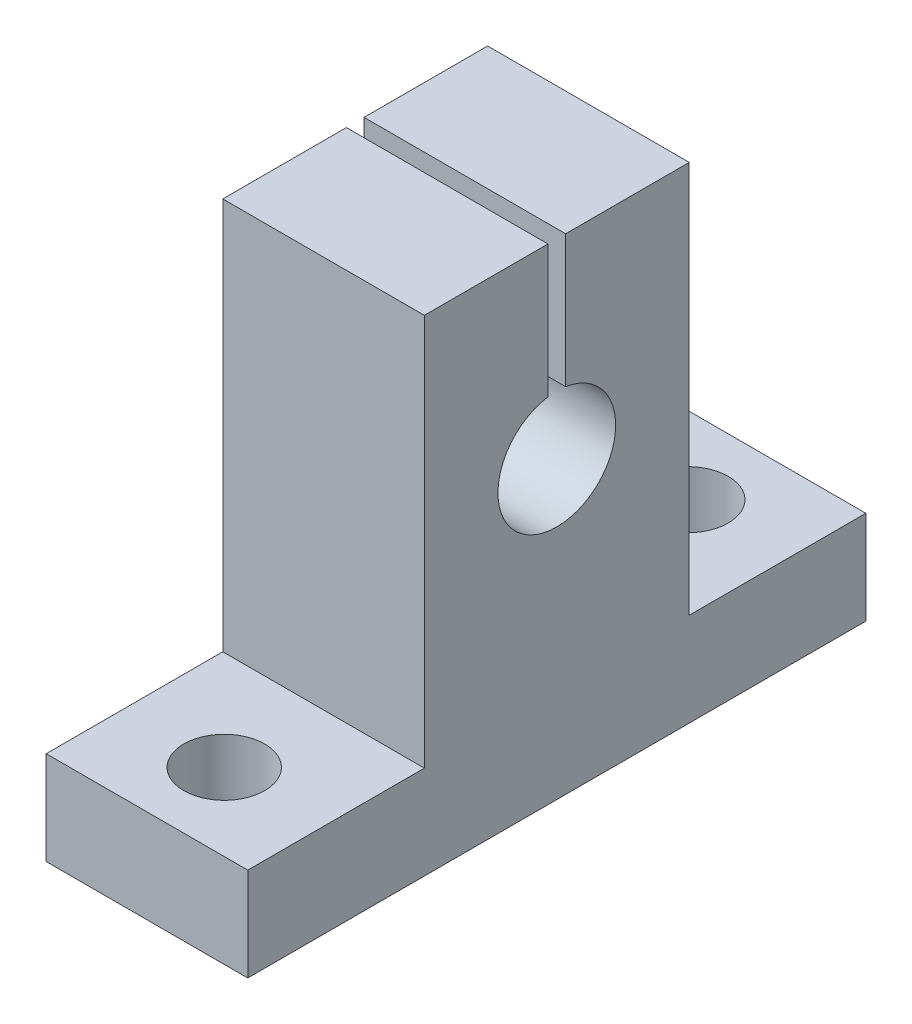
ISO-10303-21;
HEADER;
FILE_DESCRIPTION(('STEP AP214'),'2;1');
FILE_NAME('part.step','',(''),(''),'','','');
FILE_SCHEMA(('AUTOMOTIVE_DESIGN { 1 0 10303 214 1 1 1 1 }'));
ENDSEC;
DATA;
#1=APPLICATION_CONTEXT('core data for automotive mechanical design processes');
#2=APPLICATION_PROTOCOL_DEFINITION('international standard','automotive_design',2000,#1);
#3=PRODUCT_CONTEXT('',#1,'mechanical');
#4=PRODUCT('Part','Part','',(#3));
#5=PRODUCT_RELATED_PRODUCT_CATEGORY('part','',(#4));
#6=PRODUCT_DEFINITION_FORMATION('','',#4);
#7=PRODUCT_DEFINITION_CONTEXT('part definition',#1,'design');
#8=PRODUCT_DEFINITION('design','',#6,#7);
#9=PRODUCT_DEFINITION_SHAPE('','',#8);
#10=(LENGTH_UNIT() NAMED_UNIT(*) SI_UNIT(.MILLI.,.METRE.));
#11=(NAMED_UNIT(*) PLANE_ANGLE_UNIT() SI_UNIT($,.RADIAN.));
#12=(NAMED_UNIT(*) SI_UNIT($,.STERADIAN.) SOLID_ANGLE_UNIT());
#13=UNCERTAINTY_MEASURE_WITH_UNIT(LENGTH_MEASURE(1.E-05),#10,'distance_accuracy_value','');
#14=(GEOMETRIC_REPRESENTATION_CONTEXT(3) GLOBAL_UNCERTAINTY_ASSIGNED_CONTEXT((#13)) GLOBAL_UNIT_ASSIGNED_CONTEXT((#10,
#11,#12)) REPRESENTATION_CONTEXT('',''));
#15=CARTESIAN_POINT('',(0.,0.,0.));
#16=DIRECTION('',(0.,0.,1.));
#17=DIRECTION('',(1.,0.,0.));
#18=AXIS2_PLACEMENT_3D('',#15,#16,#17);
#19=CARTESIAN_POINT('',(0.,33.,0.));
#20=DIRECTION('',(0.,-1.,0.));
#21=DIRECTION('',(0.,0.,-1.));
#22=AXIS2_PLACEMENT_3D('',#19,#20,#21);
#23=PLANE('',#22);
#24=DIRECTION('',(0.,0.,-1.));
#25=VECTOR('',#24,1.);
#26=CARTESIAN_POINT('',(6.85,33.,9.));
#27=LINE('',#26,#25);
#28=CARTESIAN_POINT('',(6.85,33.,9.));
#29=VERTEX_POINT('',#28);
#30=CARTESIAN_POINT('',(6.85,33.,0.6));
#31=VERTEX_POINT('',#30);
#32=EDGE_CURVE('E154',#29,#31,#27,.T.);
#33=ORIENTED_EDGE('',*,*,#32,.T.);
#34=DIRECTION('',(-1.,0.,0.));
#35=VECTOR('',#34,1.);
#36=CARTESIAN_POINT('',(0.,33.,0.6));
#37=LINE('',#36,#35);
#38=CARTESIAN_POINT('',(-6.85,33.,0.6));
#39=VERTEX_POINT('',#38);
#40=EDGE_CURVE('E55',#31,#39,#37,.T.);
#41=ORIENTED_EDGE('',*,*,#40,.T.);
#42=DIRECTION('',(0.,0.,1.));
#43=VECTOR('',#42,1.);
#44=CARTESIAN_POINT('',(-6.85,33.,9.));
#45=LINE('',#44,#43);
#46=CARTESIAN_POINT('',(-6.85,33.,9.));
#47=VERTEX_POINT('',#46);
#48=EDGE_CURVE('E151',#39,#47,#45,.T.);
#49=ORIENTED_EDGE('',*,*,#48,.T.);
#50=DIRECTION('',(1.,0.,0.));
#51=VECTOR('',#50,1.);
#52=CARTESIAN_POINT('',(-6.85,33.,9.));
#53=LINE('',#52,#51);
#54=EDGE_CURVE('E164',#47,#29,#53,.T.);
#55=ORIENTED_EDGE('',*,*,#54,.T.);
#56=EDGE_LOOP('',(#33,#41,#49,#55));
#57=FACE_BOUND('',#56,.T.);
#58=ADVANCED_FACE('F47',(#57),#23,.F.);
#59=CARTESIAN_POINT('',(0.,6.35,0.));
#60=DIRECTION('',(0.,-1.,0.));
#61=DIRECTION('',(0.,0.,-1.));
#62=AXIS2_PLACEMENT_3D('',#59,#60,#61);
#63=PLANE('',#62);
#64=CARTESIAN_POINT('',(0.,6.35,15.75));
#65=DIRECTION('',(0.,1.,0.));
#66=DIRECTION('',(0.,0.,1.));
#67=AXIS2_PLACEMENT_3D('',#64,#65,#66);
#68=CIRCLE('',#67,2.75);
#69=CARTESIAN_POINT('',(0.,6.35,18.5));
#70=VERTEX_POINT('',#69);
#71=EDGE_CURVE('E330',#70,#70,#68,.T.);
#72=ORIENTED_EDGE('',*,*,#71,.F.);
#73=EDGE_LOOP('',(#72));
#74=FACE_BOUND('',#73,.T.);
#75=DIRECTION('',(1.,0.,0.));
#76=VECTOR('',#75,1.);
#77=CARTESIAN_POINT('',(-6.85,6.35,9.));
#78=LINE('',#77,#76);
#79=CARTESIAN_POINT('',(-6.85,6.35,9.00000000000001));
#80=VERTEX_POINT('',#79);
#81=CARTESIAN_POINT('',(6.85,6.35,9.00000000000001));
#82=VERTEX_POINT('',#81);
#83=EDGE_CURVE('E177',#80,#82,#78,.T.);
#84=ORIENTED_EDGE('',*,*,#83,.F.);
#85=DIRECTION('',(0.,0.,-1.));
#86=VECTOR('',#85,1.);
#87=CARTESIAN_POINT('',(-6.85,6.35,21.));
#88=LINE('',#87,#86);
#89=CARTESIAN_POINT('',(-6.85,6.35,21.));
#90=VERTEX_POINT('',#89);
#91=EDGE_CURVE('E222',#90,#80,#88,.T.);
#92=ORIENTED_EDGE('',*,*,#91,.F.);
#93=DIRECTION('',(1.,0.,0.));
#94=VECTOR('',#93,1.);
#95=CARTESIAN_POINT('',(-6.85,6.35,21.));
#96=LINE('',#95,#94);
#97=CARTESIAN_POINT('',(6.85,6.35,21.));
#98=VERTEX_POINT('',#97);
#99=EDGE_CURVE('E221',#90,#98,#96,.T.);
#100=ORIENTED_EDGE('',*,*,#99,.T.);
#101=DIRECTION('',(0.,0.,-1.));
#102=VECTOR('',#101,1.);
#103=CARTESIAN_POINT('',(6.85,6.35,21.));
#104=LINE('',#103,#102);
#105=EDGE_CURVE('E234',#98,#82,#104,.T.);
#106=ORIENTED_EDGE('',*,*,#105,.T.);
#107=EDGE_LOOP('',(#84,#92,#100,#106));
#108=FACE_BOUND('',#107,.T.);
#109=ADVANCED_FACE('F276',(#74,#108),#63,.F.);
#110=CARTESIAN_POINT('',(0.,6.35,-15.75));
#111=DIRECTION('',(0.,-1.,0.));
#112=DIRECTION('',(0.,0.,-1.));
#113=AXIS2_PLACEMENT_3D('',#110,#111,#112);
#114=CIRCLE('',#113,2.75);
#115=CARTESIAN_POINT('',(0.,6.35,-18.5));
#116=VERTEX_POINT('',#115);
#117=EDGE_CURVE('E327',#116,#116,#114,.T.);
#118=ORIENTED_EDGE('',*,*,#117,.T.);
#119=EDGE_LOOP('',(#118));
#120=FACE_BOUND('',#119,.T.);
#121=DIRECTION('',(-1.,0.,0.));
#122=VECTOR('',#121,1.);
#123=CARTESIAN_POINT('',(-6.85,6.35,-9.));
#124=LINE('',#123,#122);
#125=CARTESIAN_POINT('',(6.85,6.35,-8.99999999999999));
#126=VERTEX_POINT('',#125);
#127=CARTESIAN_POINT('',(-6.85,6.35,-9.));
#128=VERTEX_POINT('',#127);
#129=EDGE_CURVE('E70',#126,#128,#124,.T.);
#130=ORIENTED_EDGE('',*,*,#129,.F.);
#131=CARTESIAN_POINT('',(6.85,6.35,-21.));
#132=VERTEX_POINT('',#131);
#133=EDGE_CURVE('E179',#126,#132,#104,.T.);
#134=ORIENTED_EDGE('',*,*,#133,.T.);
#135=DIRECTION('',(1.,0.,0.));
#136=VECTOR('',#135,1.);
#137=CARTESIAN_POINT('',(-6.85,6.35,-21.));
#138=LINE('',#137,#136);
#139=CARTESIAN_POINT('',(-6.85,6.35,-21.));
#140=VERTEX_POINT('',#139);
#141=EDGE_CURVE('E224',#140,#132,#138,.T.);
#142=ORIENTED_EDGE('',*,*,#141,.F.);
#143=EDGE_CURVE('E225',#128,#140,#88,.T.);
#144=ORIENTED_EDGE('',*,*,#143,.F.);
#145=EDGE_LOOP('',(#130,#134,#142,#144));
#146=FACE_BOUND('',#145,.T.);
#147=ADVANCED_FACE('F239',(#120,#146),#63,.F.);
#148=CARTESIAN_POINT('',(-6.85,6.35,21.));
#149=DIRECTION('',(-1.,0.,0.));
#150=DIRECTION('',(0.,0.,1.));
#151=AXIS2_PLACEMENT_3D('',#148,#149,#150);
#152=PLANE('',#151);
#153=DIRECTION('',(0.,1.,0.));
#154=VECTOR('',#153,1.);
#155=CARTESIAN_POINT('',(-6.85,24.,0.6));
#156=LINE('',#155,#154);
#157=CARTESIAN_POINT('',(-6.85,24.,0.600000000000002));
#158=VERTEX_POINT('',#157);
#159=EDGE_CURVE('E136',#158,#39,#156,.T.);
#160=ORIENTED_EDGE('',*,*,#159,.F.);
#161=CARTESIAN_POINT('',(-6.85,20.045256013343,0.));
#162=DIRECTION('',(-1.,0.,0.));
#163=DIRECTION('',(0.,0.,1.));
#164=AXIS2_PLACEMENT_3D('',#161,#162,#163);
#165=CIRCLE('',#164,4.);
#166=CARTESIAN_POINT('',(-6.85,24.,-0.6));
#167=VERTEX_POINT('',#166);
#168=EDGE_CURVE('E297',#167,#158,#165,.T.);
#169=ORIENTED_EDGE('',*,*,#168,.F.);
#170=DIRECTION('',(0.,-1.,0.));
#171=VECTOR('',#170,1.);
#172=CARTESIAN_POINT('',(-6.85,24.,-0.6));
#173=LINE('',#172,#171);
#174=CARTESIAN_POINT('',(-6.85,33.,-0.6));
#175=VERTEX_POINT('',#174);
#176=EDGE_CURVE('E146',#175,#167,#173,.T.);
#177=ORIENTED_EDGE('',*,*,#176,.F.);
#178=CARTESIAN_POINT('',(-6.85,33.,-9.));
#179=VERTEX_POINT('',#178);
#180=EDGE_CURVE('E160',#179,#175,#45,.T.);
#181=ORIENTED_EDGE('',*,*,#180,.F.);
#182=DIRECTION('',(0.,-1.,0.));
#183=VECTOR('',#182,1.);
#184=CARTESIAN_POINT('',(-6.85,33.,-9.));
#185=LINE('',#184,#183);
#186=EDGE_CURVE('E182',#179,#128,#185,.T.);
#187=ORIENTED_EDGE('',*,*,#186,.T.);
#188=ORIENTED_EDGE('',*,*,#143,.T.);
#189=DIRECTION('',(0.,-1.,0.));
#190=VECTOR('',#189,1.);
#191=CARTESIAN_POINT('',(-6.85,6.35,-21.));
#192=LINE('',#191,#190);
#193=CARTESIAN_POINT('',(-6.85,0.,-21.));
#194=VERTEX_POINT('',#193);
#195=EDGE_CURVE('E219',#140,#194,#192,.T.);
#196=ORIENTED_EDGE('',*,*,#195,.T.);
#197=DIRECTION('',(0.,0.,-1.));
#198=VECTOR('',#197,1.);
#199=CARTESIAN_POINT('',(-6.85,0.,21.));
#200=LINE('',#199,#198);
#201=CARTESIAN_POINT('',(-6.85,0.,21.));
#202=VERTEX_POINT('',#201);
#203=EDGE_CURVE('E190',#202,#194,#200,.T.);
#204=ORIENTED_EDGE('',*,*,#203,.F.);
#205=DIRECTION('',(0.,-1.,0.));
#206=VECTOR('',#205,1.);
#207=CARTESIAN_POINT('',(-6.85,6.35,21.));
#208=LINE('',#207,#206);
#209=EDGE_CURVE('E203',#90,#202,#208,.T.);
#210=ORIENTED_EDGE('',*,*,#209,.F.);
#211=ORIENTED_EDGE('',*,*,#91,.T.);
#212=DIRECTION('',(0.,-1.,0.));
#213=VECTOR('',#212,1.);
#214=CARTESIAN_POINT('',(-6.85,33.,9.));
#215=LINE('',#214,#213);
#216=EDGE_CURVE('E158',#47,#80,#215,.T.);
#217=ORIENTED_EDGE('',*,*,#216,.F.);
#218=ORIENTED_EDGE('',*,*,#48,.F.);
#219=EDGE_LOOP('',(#160,#169,#177,#181,#187,#188,#196,#204,#210,#211,#217,#218));
#220=FACE_BOUND('',#219,.T.);
#221=ADVANCED_FACE('F49',(#220),#152,.T.);
#222=CARTESIAN_POINT('',(-6.85,6.35,21.));
#223=DIRECTION('',(0.,0.,-1.));
#224=DIRECTION('',(-1.,0.,0.));
#225=AXIS2_PLACEMENT_3D('',#222,#223,#224);
#226=PLANE('',#225);
#227=DIRECTION('',(1.,0.,0.));
#228=VECTOR('',#227,1.);
#229=CARTESIAN_POINT('',(-6.85,0.,21.));
#230=LINE('',#229,#228);
#231=CARTESIAN_POINT('',(6.85,0.,21.));
#232=VERTEX_POINT('',#231);
#233=EDGE_CURVE('E215',#202,#232,#230,.T.);
#234=ORIENTED_EDGE('',*,*,#233,.T.);
#235=DIRECTION('',(0.,-1.,0.));
#236=VECTOR('',#235,1.);
#237=CARTESIAN_POINT('',(6.85,6.35,21.));
#238=LINE('',#237,#236);
#239=EDGE_CURVE('E206',#98,#232,#238,.T.);
#240=ORIENTED_EDGE('',*,*,#239,.F.);
#241=ORIENTED_EDGE('',*,*,#99,.F.);
#242=ORIENTED_EDGE('',*,*,#209,.T.);
#243=EDGE_LOOP('',(#234,#240,#241,#242));
#244=FACE_BOUND('',#243,.T.);
#245=ADVANCED_FACE('F339',(#244),#226,.F.);
#246=CARTESIAN_POINT('',(6.85,6.35,21.));
#247=DIRECTION('',(-1.,0.,0.));
#248=DIRECTION('',(0.,0.,1.));
#249=AXIS2_PLACEMENT_3D('',#246,#247,#248);
#250=PLANE('',#249);
#251=CARTESIAN_POINT('',(6.85,20.045256013343,0.));
#252=DIRECTION('',(-1.,0.,0.));
#253=DIRECTION('',(0.,0.,1.));
#254=AXIS2_PLACEMENT_3D('',#251,#252,#253);
#255=CIRCLE('',#254,4.);
#256=CARTESIAN_POINT('',(6.85,24.,-0.6));
#257=VERTEX_POINT('',#256);
#258=CARTESIAN_POINT('',(6.85,24.,0.600000000000002));
#259=VERTEX_POINT('',#258);
#260=EDGE_CURVE('E13',#257,#259,#255,.T.);
#261=ORIENTED_EDGE('',*,*,#260,.T.);
#262=DIRECTION('',(0.,1.,0.));
#263=VECTOR('',#262,1.);
#264=CARTESIAN_POINT('',(6.85,6.35,0.6));
#265=LINE('',#264,#263);
#266=EDGE_CURVE('E178',#259,#31,#265,.T.);
#267=ORIENTED_EDGE('',*,*,#266,.T.);
#268=ORIENTED_EDGE('',*,*,#32,.F.);
#269=DIRECTION('',(0.,-1.,0.));
#270=VECTOR('',#269,1.);
#271=CARTESIAN_POINT('',(6.85,33.,9.));
#272=LINE('',#271,#270);
#273=EDGE_CURVE('E169',#29,#82,#272,.T.);
#274=ORIENTED_EDGE('',*,*,#273,.T.);
#275=ORIENTED_EDGE('',*,*,#105,.F.);
#276=ORIENTED_EDGE('',*,*,#239,.T.);
#277=DIRECTION('',(0.,0.,-1.));
#278=VECTOR('',#277,1.);
#279=CARTESIAN_POINT('',(6.85,0.,21.));
#280=LINE('',#279,#278);
#281=CARTESIAN_POINT('',(6.85,0.,-21.));
#282=VERTEX_POINT('',#281);
#283=EDGE_CURVE('E245',#232,#282,#280,.T.);
#284=ORIENTED_EDGE('',*,*,#283,.T.);
#285=DIRECTION('',(0.,-1.,0.));
#286=VECTOR('',#285,1.);
#287=CARTESIAN_POINT('',(6.85,6.35,-21.));
#288=LINE('',#287,#286);
#289=EDGE_CURVE('E212',#132,#282,#288,.T.);
#290=ORIENTED_EDGE('',*,*,#289,.F.);
#291=ORIENTED_EDGE('',*,*,#133,.F.);
#292=DIRECTION('',(0.,-1.,0.));
#293=VECTOR('',#292,1.);
#294=CARTESIAN_POINT('',(6.85,33.,-9.));
#295=LINE('',#294,#293);
#296=CARTESIAN_POINT('',(6.85,33.,-9.));
#297=VERTEX_POINT('',#296);
#298=EDGE_CURVE('E185',#297,#126,#295,.T.);
#299=ORIENTED_EDGE('',*,*,#298,.F.);
#300=CARTESIAN_POINT('',(6.85,33.,-0.6));
#301=VERTEX_POINT('',#300);
#302=EDGE_CURVE('E195',#301,#297,#27,.T.);
#303=ORIENTED_EDGE('',*,*,#302,.F.);
#304=DIRECTION('',(0.,-1.,0.));
#305=VECTOR('',#304,1.);
#306=CARTESIAN_POINT('',(6.85,6.35,-0.6));
#307=LINE('',#306,#305);
#308=EDGE_CURVE('E62',#301,#257,#307,.T.);
#309=ORIENTED_EDGE('',*,*,#308,.T.);
#310=EDGE_LOOP('',(#261,#267,#268,#274,#275,#276,#284,#290,#291,#299,#303,#309));
#311=FACE_BOUND('',#310,.T.);
#312=ADVANCED_FACE('F243',(#311),#250,.F.);
#313=CARTESIAN_POINT('',(-6.85,6.35,-21.));
#314=DIRECTION('',(0.,0.,-1.));
#315=DIRECTION('',(-1.,0.,0.));
#316=AXIS2_PLACEMENT_3D('',#313,#314,#315);
#317=PLANE('',#316);
#318=DIRECTION('',(1.,0.,0.));
#319=VECTOR('',#318,1.);
#320=CARTESIAN_POINT('',(-6.85,0.,-21.));
#321=LINE('',#320,#319);
#322=EDGE_CURVE('E251',#194,#282,#321,.T.);
#323=ORIENTED_EDGE('',*,*,#322,.F.);
#324=ORIENTED_EDGE('',*,*,#195,.F.);
#325=ORIENTED_EDGE('',*,*,#141,.T.);
#326=ORIENTED_EDGE('',*,*,#289,.T.);
#327=EDGE_LOOP('',(#323,#324,#325,#326));
#328=FACE_BOUND('',#327,.T.);
#329=ADVANCED_FACE('F250',(#328),#317,.T.);
#330=CARTESIAN_POINT('',(0.,0.,0.));
#331=DIRECTION('',(0.,-1.,0.));
#332=DIRECTION('',(0.,0.,-1.));
#333=AXIS2_PLACEMENT_3D('',#330,#331,#332);
#334=PLANE('',#333);
#335=CARTESIAN_POINT('',(0.,0.,-15.75));
#336=DIRECTION('',(0.,-1.,0.));
#337=DIRECTION('',(0.,0.,-1.));
#338=AXIS2_PLACEMENT_3D('',#335,#336,#337);
#339=CIRCLE('',#338,2.75);
#340=CARTESIAN_POINT('',(0.,0.,-18.5));
#341=VERTEX_POINT('',#340);
#342=EDGE_CURVE('E324',#341,#341,#339,.T.);
#343=ORIENTED_EDGE('',*,*,#342,.F.);
#344=EDGE_LOOP('',(#343));
#345=FACE_BOUND('',#344,.T.);
#346=CARTESIAN_POINT('',(0.,0.,15.75));
#347=DIRECTION('',(0.,1.,0.));
#348=DIRECTION('',(0.,0.,1.));
#349=AXIS2_PLACEMENT_3D('',#346,#347,#348);
#350=CIRCLE('',#349,2.75);
#351=CARTESIAN_POINT('',(0.,0.,18.5));
#352=VERTEX_POINT('',#351);
#353=EDGE_CURVE('E147',#352,#352,#350,.T.);
#354=ORIENTED_EDGE('',*,*,#353,.T.);
#355=EDGE_LOOP('',(#354));
#356=FACE_BOUND('',#355,.T.);
#357=ORIENTED_EDGE('',*,*,#203,.T.);
#358=ORIENTED_EDGE('',*,*,#322,.T.);
#359=ORIENTED_EDGE('',*,*,#283,.F.);
#360=ORIENTED_EDGE('',*,*,#233,.F.);
#361=EDGE_LOOP('',(#357,#358,#359,#360));
#362=FACE_BOUND('',#361,.T.);
#363=ADVANCED_FACE('F259',(#345,#356,#362),#334,.T.);
#364=CARTESIAN_POINT('',(-6.85,33.,-9.));
#365=DIRECTION('',(0.,0.,1.));
#366=DIRECTION('',(1.,0.,0.));
#367=AXIS2_PLACEMENT_3D('',#364,#365,#366);
#368=PLANE('',#367);
#369=ORIENTED_EDGE('',*,*,#129,.T.);
#370=ORIENTED_EDGE('',*,*,#186,.F.);
#371=DIRECTION('',(-1.,0.,0.));
#372=VECTOR('',#371,1.);
#373=CARTESIAN_POINT('',(-6.85,33.,-9.));
#374=LINE('',#373,#372);
#375=EDGE_CURVE('E161',#297,#179,#374,.T.);
#376=ORIENTED_EDGE('',*,*,#375,.F.);
#377=ORIENTED_EDGE('',*,*,#298,.T.);
#378=EDGE_LOOP('',(#369,#370,#376,#377));
#379=FACE_BOUND('',#378,.T.);
#380=ADVANCED_FACE('F261',(#379),#368,.F.);
#381=CARTESIAN_POINT('',(-6.85,33.,9.));
#382=DIRECTION('',(0.,0.,-1.));
#383=DIRECTION('',(-1.,0.,0.));
#384=AXIS2_PLACEMENT_3D('',#381,#382,#383);
#385=PLANE('',#384);
#386=ORIENTED_EDGE('',*,*,#83,.T.);
#387=ORIENTED_EDGE('',*,*,#273,.F.);
#388=ORIENTED_EDGE('',*,*,#54,.F.);
#389=ORIENTED_EDGE('',*,*,#216,.T.);
#390=EDGE_LOOP('',(#386,#387,#388,#389));
#391=FACE_BOUND('',#390,.T.);
#392=ADVANCED_FACE('F268',(#391),#385,.F.);
#393=ORIENTED_EDGE('',*,*,#180,.T.);
#394=DIRECTION('',(1.,0.,0.));
#395=VECTOR('',#394,1.);
#396=CARTESIAN_POINT('',(0.,33.,-0.6));
#397=LINE('',#396,#395);
#398=EDGE_CURVE('E155',#175,#301,#397,.T.);
#399=ORIENTED_EDGE('',*,*,#398,.T.);
#400=ORIENTED_EDGE('',*,*,#302,.T.);
#401=ORIENTED_EDGE('',*,*,#375,.T.);
#402=EDGE_LOOP('',(#393,#399,#400,#401));
#403=FACE_BOUND('',#402,.T.);
#404=ADVANCED_FACE('F278',(#403),#23,.F.);
#405=CARTESIAN_POINT('',(6.85005,20.045256013343,0.));
#406=DIRECTION('',(-1.,0.,0.));
#407=DIRECTION('',(0.,0.,1.));
#408=AXIS2_PLACEMENT_3D('',#405,#406,#407);
#409=CYLINDRICAL_SURFACE('',#408,4.);
#410=DIRECTION('',(-1.,0.,0.));
#411=VECTOR('',#410,1.);
#412=CARTESIAN_POINT('',(6.85005,24.,-0.6));
#413=LINE('',#412,#411);
#414=EDGE_CURVE('E299',#257,#167,#413,.T.);
#415=ORIENTED_EDGE('',*,*,#414,.T.);
#416=ORIENTED_EDGE('',*,*,#168,.T.);
#417=DIRECTION('',(-1.,0.,0.));
#418=VECTOR('',#417,1.);
#419=CARTESIAN_POINT('',(6.85005,24.,0.600000000000002));
#420=LINE('',#419,#418);
#421=EDGE_CURVE('E141',#259,#158,#420,.T.);
#422=ORIENTED_EDGE('',*,*,#421,.F.);
#423=ORIENTED_EDGE('',*,*,#260,.F.);
#424=EDGE_LOOP('',(#415,#416,#422,#423));
#425=FACE_BOUND('',#424,.T.);
#426=ADVANCED_FACE('F286',(#425),#409,.F.);
#427=CARTESIAN_POINT('',(6.85005,24.,0.6));
#428=DIRECTION('',(0.,0.,1.));
#429=DIRECTION('',(0.,-1.,0.));
#430=AXIS2_PLACEMENT_3D('',#427,#428,#429);
#431=PLANE('',#430);
#432=ORIENTED_EDGE('',*,*,#421,.T.);
#433=ORIENTED_EDGE('',*,*,#159,.T.);
#434=ORIENTED_EDGE('',*,*,#40,.F.);
#435=ORIENTED_EDGE('',*,*,#266,.F.);
#436=EDGE_LOOP('',(#432,#433,#434,#435));
#437=FACE_BOUND('',#436,.T.);
#438=ADVANCED_FACE('F138',(#437),#431,.F.);
#439=CARTESIAN_POINT('',(6.85005,24.,-0.6));
#440=DIRECTION('',(0.,0.,-1.));
#441=DIRECTION('',(-1.,0.,0.));
#442=AXIS2_PLACEMENT_3D('',#439,#440,#441);
#443=PLANE('',#442);
#444=ORIENTED_EDGE('',*,*,#398,.F.);
#445=ORIENTED_EDGE('',*,*,#176,.T.);
#446=ORIENTED_EDGE('',*,*,#414,.F.);
#447=ORIENTED_EDGE('',*,*,#308,.F.);
#448=EDGE_LOOP('',(#444,#445,#446,#447));
#449=FACE_BOUND('',#448,.T.);
#450=ADVANCED_FACE('F306',(#449),#443,.F.);
#451=CARTESIAN_POINT('',(0.,0.,15.75));
#452=DIRECTION('',(0.,1.,0.));
#453=DIRECTION('',(0.,0.,1.));
#454=AXIS2_PLACEMENT_3D('',#451,#452,#453);
#455=CYLINDRICAL_SURFACE('',#454,2.75);
#456=ORIENTED_EDGE('',*,*,#353,.F.);
#457=EDGE_LOOP('',(#456));
#458=FACE_BOUND('',#457,.T.);
#459=ORIENTED_EDGE('',*,*,#71,.T.);
#460=EDGE_LOOP('',(#459));
#461=FACE_BOUND('',#460,.T.);
#462=ADVANCED_FACE('F308',(#458,#461),#455,.F.);
#463=CARTESIAN_POINT('',(0.,0.,-15.75));
#464=DIRECTION('',(0.,1.,0.));
#465=DIRECTION('',(0.,0.,1.));
#466=AXIS2_PLACEMENT_3D('',#463,#464,#465);
#467=CYLINDRICAL_SURFACE('',#466,2.75);
#468=ORIENTED_EDGE('',*,*,#342,.T.);
#469=EDGE_LOOP('',(#468));
#470=FACE_BOUND('',#469,.T.);
#471=ORIENTED_EDGE('',*,*,#117,.F.);
#472=EDGE_LOOP('',(#471));
#473=FACE_BOUND('',#472,.T.);
#474=ADVANCED_FACE('F314',(#470,#473),#467,.F.);
#475=CLOSED_SHELL('',(#58,#109,#147,#221,#245,#312,#329,#363,#380,#392,#404,#426,#438,#450,#462,#474));
#476=MANIFOLD_SOLID_BREP('B2',#475);
#477=ADVANCED_BREP_SHAPE_REPRESENTATION('',(#18,#476),#14);
#478=SHAPE_DEFINITION_REPRESENTATION(#9,#477);
ENDSEC;
END-ISO-10303-21;
